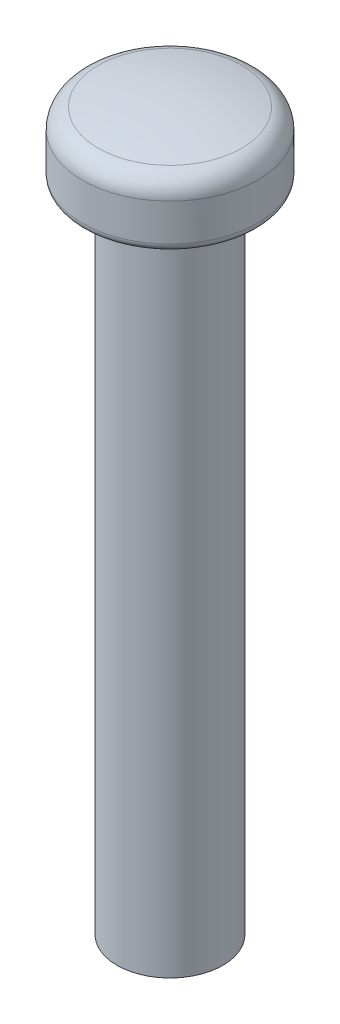
ISO-10303-21;
HEADER;
FILE_DESCRIPTION(('STEP AP214'),'2;1');
FILE_NAME('part.step','',(''),(''),'','','');
FILE_SCHEMA(('AUTOMOTIVE_DESIGN { 1 0 10303 214 1 1 1 1 }'));
ENDSEC;
DATA;
#1=APPLICATION_CONTEXT('core data for automotive mechanical design processes');
#2=APPLICATION_PROTOCOL_DEFINITION('international standard','automotive_design',2000,#1);
#3=PRODUCT_CONTEXT('',#1,'mechanical');
#4=PRODUCT('Part','Part','',(#3));
#5=PRODUCT_RELATED_PRODUCT_CATEGORY('part','',(#4));
#6=PRODUCT_DEFINITION_FORMATION('','',#4);
#7=PRODUCT_DEFINITION_CONTEXT('part definition',#1,'design');
#8=PRODUCT_DEFINITION('design','',#6,#7);
#9=PRODUCT_DEFINITION_SHAPE('','',#8);
#10=(LENGTH_UNIT() NAMED_UNIT(*) SI_UNIT(.MILLI.,.METRE.));
#11=(NAMED_UNIT(*) PLANE_ANGLE_UNIT() SI_UNIT($,.RADIAN.));
#12=(NAMED_UNIT(*) SI_UNIT($,.STERADIAN.) SOLID_ANGLE_UNIT());
#13=UNCERTAINTY_MEASURE_WITH_UNIT(LENGTH_MEASURE(1.E-05),#10,'distance_accuracy_value','');
#14=(GEOMETRIC_REPRESENTATION_CONTEXT(3) GLOBAL_UNCERTAINTY_ASSIGNED_CONTEXT((#13)) GLOBAL_UNIT_ASSIGNED_CONTEXT((#10,
#11,#12)) REPRESENTATION_CONTEXT('',''));
#15=CARTESIAN_POINT('',(0.,0.,0.));
#16=DIRECTION('',(0.,0.,1.));
#17=DIRECTION('',(1.,0.,0.));
#18=AXIS2_PLACEMENT_3D('',#15,#16,#17);
#19=CARTESIAN_POINT('',(0.,-6.05416666666669,0.));
#20=DIRECTION('',(1.,0.,0.));
#21=DIRECTION('',(0.,-1.,0.));
#22=AXIS2_PLACEMENT_3D('',#19,#20,#21);
#23=SPHERICAL_SURFACE('',#22,7.85416666666667);
#24=CARTESIAN_POINT('',(0.,1.59976376695538,0.));
#25=DIRECTION('',(0.,-1.,0.));
#26=DIRECTION('',(1.,0.,0.));
#27=AXIS2_PLACEMENT_3D('',#24,#25,#26);
#28=CIRCLE('',#27,1.7621813031161);
#29=CARTESIAN_POINT('',(1.76218130311611,1.59976376695538,0.));
#30=VERTEX_POINT('',#29);
#31=EDGE_CURVE('E115',#30,#30,#28,.T.);
#32=ORIENTED_EDGE('',*,*,#31,.F.);
#33=EDGE_LOOP('',(#32));
#34=FACE_BOUND('',#33,.T.);
#35=ADVANCED_FACE('F17',(#34),#23,.T.);
#36=CARTESIAN_POINT('',(0.,1.1125109011545,0.));
#37=DIRECTION('',(0.,-1.,0.));
#38=DIRECTION('',(1.,0.,0.));
#39=AXIS2_PLACEMENT_3D('',#36,#37,#38);
#40=TOROIDAL_SURFACE('',#39,1.65,0.5);
#41=ORIENTED_EDGE('',*,*,#31,.T.);
#42=EDGE_LOOP('',(#41));
#43=FACE_BOUND('',#42,.T.);
#44=CARTESIAN_POINT('',(0.,1.1125109011545,0.));
#45=DIRECTION('',(0.,1.,0.));
#46=DIRECTION('',(-1.,0.,0.));
#47=AXIS2_PLACEMENT_3D('',#44,#45,#46);
#48=CIRCLE('',#47,2.15);
#49=CARTESIAN_POINT('',(-2.15,1.1125109011545,0.));
#50=VERTEX_POINT('',#49);
#51=EDGE_CURVE('E89',#50,#50,#48,.F.);
#52=ORIENTED_EDGE('',*,*,#51,.F.);
#53=EDGE_LOOP('',(#52));
#54=FACE_BOUND('',#53,.T.);
#55=ADVANCED_FACE('F92',(#43,#54),#40,.T.);
#56=CARTESIAN_POINT('',(0.,1.80000000000002,0.));
#57=DIRECTION('',(0.,1.,0.));
#58=DIRECTION('',(-1.,0.,0.));
#59=AXIS2_PLACEMENT_3D('',#56,#57,#58);
#60=CYLINDRICAL_SURFACE('',#59,2.15);
#61=CARTESIAN_POINT('',(0.,0.199999999999978,0.));
#62=DIRECTION('',(0.,1.,0.));
#63=DIRECTION('',(-1.,0.,0.));
#64=AXIS2_PLACEMENT_3D('',#61,#62,#63);
#65=CIRCLE('',#64,2.15);
#66=CARTESIAN_POINT('',(-2.15,0.199999999999978,0.));
#67=VERTEX_POINT('',#66);
#68=EDGE_CURVE('E47',#67,#67,#65,.F.);
#69=ORIENTED_EDGE('',*,*,#68,.F.);
#70=EDGE_LOOP('',(#69));
#71=FACE_BOUND('',#70,.T.);
#72=ORIENTED_EDGE('',*,*,#51,.T.);
#73=EDGE_LOOP('',(#72));
#74=FACE_BOUND('',#73,.T.);
#75=ADVANCED_FACE('F77',(#71,#74),#60,.T.);
#76=CARTESIAN_POINT('',(0.,0.199999999999978,0.));
#77=DIRECTION('',(0.,1.,0.));
#78=DIRECTION('',(-1.,0.,0.));
#79=AXIS2_PLACEMENT_3D('',#76,#77,#78);
#80=TOROIDAL_SURFACE('',#79,1.95,0.2);
#81=CARTESIAN_POINT('',(0.,0.,0.));
#82=DIRECTION('',(0.,1.,0.));
#83=DIRECTION('',(-1.,0.,0.));
#84=AXIS2_PLACEMENT_3D('',#81,#82,#83);
#85=CIRCLE('',#84,1.95);
#86=CARTESIAN_POINT('',(-1.95,0.,0.));
#87=VERTEX_POINT('',#86);
#88=CARTESIAN_POINT('',(1.95,0.,0.));
#89=VERTEX_POINT('',#88);
#90=EDGE_CURVE('E35',#87,#89,#85,.T.);
#91=ORIENTED_EDGE('',*,*,#90,.T.);
#92=CARTESIAN_POINT('',(0.,0.,0.));
#93=DIRECTION('',(0.,1.,0.));
#94=DIRECTION('',(1.,0.,0.));
#95=AXIS2_PLACEMENT_3D('',#92,#93,#94);
#96=CIRCLE('',#95,1.95);
#97=EDGE_CURVE('E37',#89,#87,#96,.T.);
#98=ORIENTED_EDGE('',*,*,#97,.T.);
#99=EDGE_LOOP('',(#91,#98));
#100=FACE_BOUND('',#99,.T.);
#101=ORIENTED_EDGE('',*,*,#68,.T.);
#102=EDGE_LOOP('',(#101));
#103=FACE_BOUND('',#102,.T.);
#104=ADVANCED_FACE('F39',(#100,#103),#80,.T.);
#105=CARTESIAN_POINT('',(0.,-16.,0.));
#106=DIRECTION('',(0.,-1.,0.));
#107=DIRECTION('',(0.,0.,-1.));
#108=AXIS2_PLACEMENT_3D('',#105,#106,#107);
#109=PLANE('',#108);
#110=CARTESIAN_POINT('',(0.,-16.,0.));
#111=DIRECTION('',(0.,1.,0.));
#112=DIRECTION('',(0.,0.,1.));
#113=AXIS2_PLACEMENT_3D('',#110,#111,#112);
#114=CIRCLE('',#113,1.3);
#115=CARTESIAN_POINT('',(0.,-16.,1.3));
#116=VERTEX_POINT('',#115);
#117=EDGE_CURVE('E28',#116,#116,#114,.T.);
#118=ORIENTED_EDGE('',*,*,#117,.F.);
#119=EDGE_LOOP('',(#118));
#120=FACE_BOUND('',#119,.T.);
#121=ADVANCED_FACE('F63',(#120),#109,.T.);
#122=CARTESIAN_POINT('',(0.,0.,0.));
#123=DIRECTION('',(0.,1.,0.));
#124=DIRECTION('',(-1.,0.,0.));
#125=AXIS2_PLACEMENT_3D('',#122,#123,#124);
#126=PLANE('',#125);
#127=CARTESIAN_POINT('',(0.,0.,0.));
#128=DIRECTION('',(0.,1.,0.));
#129=DIRECTION('',(0.,0.,1.));
#130=AXIS2_PLACEMENT_3D('',#127,#128,#129);
#131=CIRCLE('',#130,1.3);
#132=CARTESIAN_POINT('',(0.,0.,1.3));
#133=VERTEX_POINT('',#132);
#134=EDGE_CURVE('E11',#133,#133,#131,.F.);
#135=ORIENTED_EDGE('',*,*,#134,.F.);
#136=EDGE_LOOP('',(#135));
#137=FACE_BOUND('',#136,.T.);
#138=ORIENTED_EDGE('',*,*,#90,.F.);
#139=ORIENTED_EDGE('',*,*,#97,.F.);
#140=EDGE_LOOP('',(#138,#139));
#141=FACE_BOUND('',#140,.T.);
#142=ADVANCED_FACE('F46',(#137,#141),#126,.F.);
#143=CARTESIAN_POINT('',(0.,-16.,0.));
#144=DIRECTION('',(0.,1.,0.));
#145=DIRECTION('',(0.,0.,1.));
#146=AXIS2_PLACEMENT_3D('',#143,#144,#145);
#147=CYLINDRICAL_SURFACE('',#146,1.3);
#148=ORIENTED_EDGE('',*,*,#134,.T.);
#149=EDGE_LOOP('',(#148));
#150=FACE_BOUND('',#149,.T.);
#151=ORIENTED_EDGE('',*,*,#117,.T.);
#152=EDGE_LOOP('',(#151));
#153=FACE_BOUND('',#152,.T.);
#154=ADVANCED_FACE('F62',(#150,#153),#147,.T.);
#155=CLOSED_SHELL('',(#35,#55,#75,#104,#121,#142,#154));
#156=MANIFOLD_SOLID_BREP('B1',#155);
#157=ADVANCED_BREP_SHAPE_REPRESENTATION('',(#18,#156),#14);
#158=SHAPE_DEFINITION_REPRESENTATION(#9,#157);
ENDSEC;
END-ISO-10303-21;
